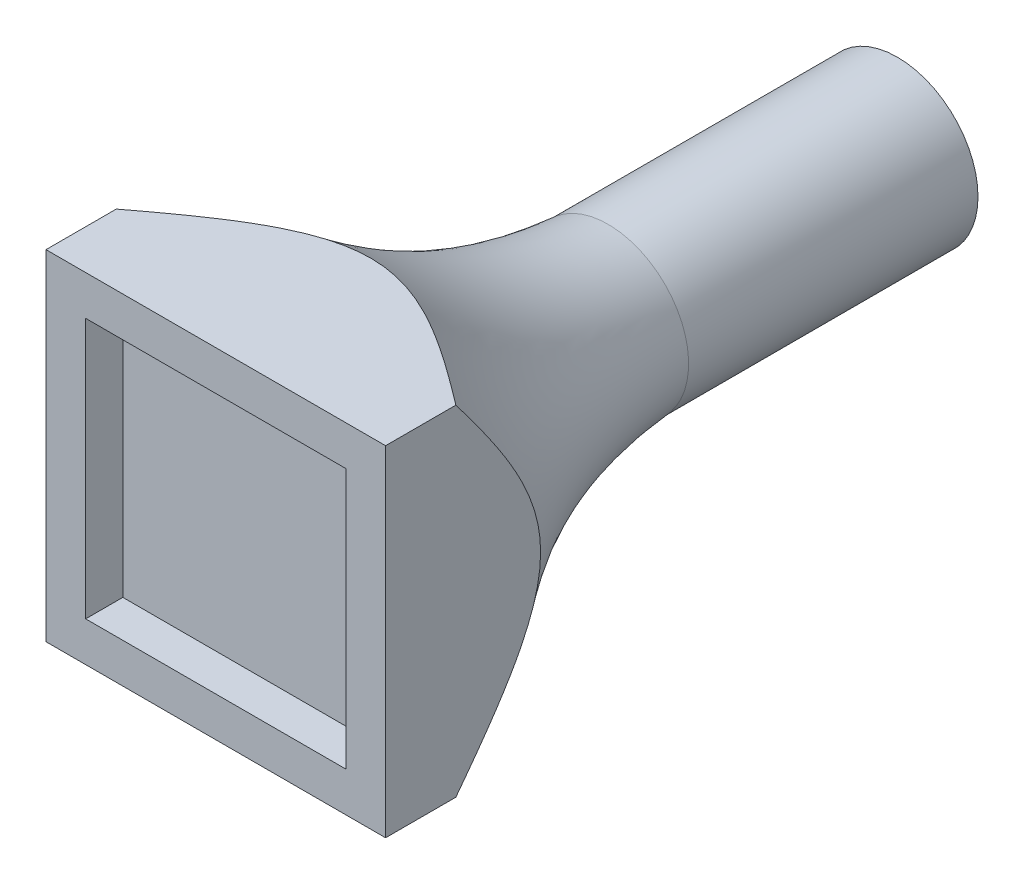
ISO-10303-21;
HEADER;
FILE_DESCRIPTION(('STEP AP214'),'2;1');
FILE_NAME('part.step','',(''),(''),'','','');
FILE_SCHEMA(('AUTOMOTIVE_DESIGN { 1 0 10303 214 1 1 1 1 }'));
ENDSEC;
DATA;
#1=APPLICATION_CONTEXT('core data for automotive mechanical design processes');
#2=APPLICATION_PROTOCOL_DEFINITION('international standard','automotive_design',2000,#1);
#3=PRODUCT_CONTEXT('',#1,'mechanical');
#4=PRODUCT('Part','Part','',(#3));
#5=PRODUCT_RELATED_PRODUCT_CATEGORY('part','',(#4));
#6=PRODUCT_DEFINITION_FORMATION('','',#4);
#7=PRODUCT_DEFINITION_CONTEXT('part definition',#1,'design');
#8=PRODUCT_DEFINITION('design','',#6,#7);
#9=PRODUCT_DEFINITION_SHAPE('','',#8);
#10=(LENGTH_UNIT() NAMED_UNIT(*) SI_UNIT(.MILLI.,.METRE.));
#11=(NAMED_UNIT(*) PLANE_ANGLE_UNIT() SI_UNIT($,.RADIAN.));
#12=(NAMED_UNIT(*) SI_UNIT($,.STERADIAN.) SOLID_ANGLE_UNIT());
#13=UNCERTAINTY_MEASURE_WITH_UNIT(LENGTH_MEASURE(1.E-05),#10,'distance_accuracy_value','');
#14=(GEOMETRIC_REPRESENTATION_CONTEXT(3) GLOBAL_UNCERTAINTY_ASSIGNED_CONTEXT((#13)) GLOBAL_UNIT_ASSIGNED_CONTEXT((#10,
#11,#12)) REPRESENTATION_CONTEXT('',''));
#15=CARTESIAN_POINT('',(0.,0.,0.));
#16=DIRECTION('',(0.,0.,1.));
#17=DIRECTION('',(1.,0.,0.));
#18=AXIS2_PLACEMENT_3D('',#15,#16,#17);
#19=CARTESIAN_POINT('',(13.7,13.7,55.));
#20=DIRECTION('',(-1.,0.,0.));
#21=DIRECTION('',(0.,-1.,0.));
#22=AXIS2_PLACEMENT_3D('',#19,#20,#21);
#23=PLANE('',#22);
#24=DIRECTION('',(0.,0.,-1.));
#25=VECTOR('',#24,1.);
#26=CARTESIAN_POINT('',(13.7,-13.7,55.));
#27=LINE('',#26,#25);
#28=CARTESIAN_POINT('',(13.7,-13.7,55.));
#29=VERTEX_POINT('',#28);
#30=CARTESIAN_POINT('',(13.7,-13.7,49.3319690130509));
#31=VERTEX_POINT('',#30);
#32=EDGE_CURVE('E286',#29,#31,#27,.T.);
#33=ORIENTED_EDGE('',*,*,#32,.T.);
#34=CARTESIAN_POINT('',(13.7,13.7,49.3319690130508));
#35=CARTESIAN_POINT('',(13.7,13.4529593319036,49.1436677663841));
#36=CARTESIAN_POINT('',(13.7,13.2054086943863,48.9560301564443));
#37=CARTESIAN_POINT('',(13.7,12.7082563871221,48.5818774315628));
#38=CARTESIAN_POINT('',(13.7,12.4586507358479,48.3953676097145));
#39=CARTESIAN_POINT('',(13.7,11.9573428621229,48.0240357854787));
#40=CARTESIAN_POINT('',(13.7,11.7056372585732,47.8392183409763));
#41=CARTESIAN_POINT('',(13.7,11.2000154207749,47.4719330033712));
#42=CARTESIAN_POINT('',(13.7,10.9460967400396,47.2894684734799));
#43=CARTESIAN_POINT('',(13.7,10.4358682857531,46.9276401919869));
#44=CARTESIAN_POINT('',(13.7,10.1795573979703,46.7482780090311));
#45=CARTESIAN_POINT('',(13.7,9.6521994413727,46.385202456641));
#46=CARTESIAN_POINT('',(13.7,9.38102289730896,46.2016766765887));
#47=CARTESIAN_POINT('',(13.7,8.8352800973779,45.840090651467));
#48=CARTESIAN_POINT('',(13.7,8.56071602879636,45.662027114441));
#49=CARTESIAN_POINT('',(13.7,8.0076094365377,45.3127245355967));
#50=CARTESIAN_POINT('',(13.7,7.72907070884515,45.1414795061764));
#51=CARTESIAN_POINT('',(13.7,7.1672617743155,44.8074452261275));
#52=CARTESIAN_POINT('',(13.7,6.88399568723085,44.6446490740098));
#53=CARTESIAN_POINT('',(13.7,6.31175806319427,44.3294662735099));
#54=CARTESIAN_POINT('',(13.7,6.02278764850594,44.1770776033687));
#55=CARTESIAN_POINT('',(13.7,5.52137157165149,43.9267521161752));
#56=CARTESIAN_POINT('',(13.7,5.31051006515778,43.8256456939996));
#57=CARTESIAN_POINT('',(13.7,4.88517843415764,43.6312252023687));
#58=CARTESIAN_POINT('',(13.7,4.67070791504506,43.5379119917554));
#59=CARTESIAN_POINT('',(13.7,4.23797729295138,43.3603668333435));
#60=CARTESIAN_POINT('',(13.7,4.01971653208071,43.2761364807657));
#61=CARTESIAN_POINT('',(13.7,3.58147428392627,43.1189520003611));
#62=CARTESIAN_POINT('',(13.7,3.36152851776665,43.0458988855125));
#63=CARTESIAN_POINT('',(13.7,2.91805492833534,42.9116039679602));
#64=CARTESIAN_POINT('',(13.7,2.69452737514733,42.8503612791917));
#65=CARTESIAN_POINT('',(13.7,2.24427357761111,42.7411642421615));
#66=CARTESIAN_POINT('',(13.7,2.01754810491023,42.693206743982));
#67=CARTESIAN_POINT('',(13.7,1.59849076070551,42.618492075058));
#68=CARTESIAN_POINT('',(13.7,1.40654672076051,42.5895576884166));
#69=CARTESIAN_POINT('',(13.7,1.02132304738292,42.5425624408081));
#70=CARTESIAN_POINT('',(13.7,0.828043435110975,42.5245014079627));
#71=CARTESIAN_POINT('',(13.7,0.440783840593894,42.4996770864843));
#72=CARTESIAN_POINT('',(13.7,0.246803963374242,42.4929121688959));
#73=CARTESIAN_POINT('',(13.7,-0.141167604163201,42.4908382942361));
#74=CARTESIAN_POINT('',(13.7,-0.335159278727361,42.49552640315));
#75=CARTESIAN_POINT('',(13.7,-0.722562073735484,42.5162411592981));
#76=CARTESIAN_POINT('',(13.7,-0.915973104567532,42.532269474592));
#77=CARTESIAN_POINT('',(13.7,-1.30156362619016,42.5752867887748));
#78=CARTESIAN_POINT('',(13.7,-1.49374308682004,42.6022760550592));
#79=CARTESIAN_POINT('',(13.7,-1.93414257005715,42.676348103267));
#80=CARTESIAN_POINT('',(13.7,-2.18175925269245,42.727037601292));
#81=CARTESIAN_POINT('',(13.7,-2.67325309259267,42.8443287631922));
#82=CARTESIAN_POINT('',(13.7,-2.91712866902882,42.9109369666808));
#83=CARTESIAN_POINT('',(13.7,-3.40061940580901,43.0581550125064));
#84=CARTESIAN_POINT('',(13.7,-3.64023399190404,43.1387667265509));
#85=CARTESIAN_POINT('',(13.7,-4.11772809613263,43.3130657312705));
#86=CARTESIAN_POINT('',(13.7,-4.35555662218088,43.4068917195769));
#87=CARTESIAN_POINT('',(13.7,-4.82670472716805,43.605043116729));
#88=CARTESIAN_POINT('',(13.7,-5.06002537158895,43.7093660074264));
#89=CARTESIAN_POINT('',(13.7,-5.52244562199262,43.9268856449548));
#90=CARTESIAN_POINT('',(13.7,-5.75154558192341,44.040081643462));
#91=CARTESIAN_POINT('',(13.7,-6.26103148751497,44.3023223562161));
#92=CARTESIAN_POINT('',(13.7,-6.54036861488167,44.4533995591554));
#93=CARTESIAN_POINT('',(13.7,-7.09383057314619,44.7648344315505));
#94=CARTESIAN_POINT('',(13.7,-7.36795477805446,44.9251932063431));
#95=CARTESIAN_POINT('',(13.7,-7.91186617286955,45.2534780872752));
#96=CARTESIAN_POINT('',(13.7,-8.18165035124725,45.4214091644557));
#97=CARTESIAN_POINT('',(13.7,-8.71756365352042,45.7634140608311));
#98=CARTESIAN_POINT('',(13.7,-8.98368993192364,45.9374923235439));
#99=CARTESIAN_POINT('',(13.7,-9.51282307289084,46.2906039608608));
#100=CARTESIAN_POINT('',(13.7,-9.77582826855052,46.4696398268486));
#101=CARTESIAN_POINT('',(13.7,-10.2869012570364,46.8232063140213));
#102=CARTESIAN_POINT('',(13.7,-10.5350935009813,46.9975574564434));
#103=CARTESIAN_POINT('',(13.7,-11.0292915006364,47.3491176776357));
#104=CARTESIAN_POINT('',(13.7,-11.2752980987054,47.5263255740577));
#105=CARTESIAN_POINT('',(13.7,-11.7653016596219,47.882944839558));
#106=CARTESIAN_POINT('',(13.7,-12.0093005009323,48.0623536309329));
#107=CARTESIAN_POINT('',(13.7,-12.4954081319328,48.4227972348016));
#108=CARTESIAN_POINT('',(13.7,-12.737519543178,48.6038285166026));
#109=CARTESIAN_POINT('',(13.7,-13.2199123450693,48.9670233772547));
#110=CARTESIAN_POINT('',(13.7,-13.4601968483078,49.1491828200272));
#111=CARTESIAN_POINT('',(13.7,-13.7,49.3319690130509));
#112=B_SPLINE_CURVE_WITH_KNOTS('',3,(#34,#35,#36,#37,#38,#39,#40,#41,#42,#43,#44,#45,#46,#47,
#48,#49,#50,#51,#52,#53,#54,#55,#56,#57,#58,#59,#60,#61,#62,#63,#64,#65,#66,#67,#68,#69,#70,#71,
#72,#73,#74,#75,#76,#77,#78,#79,#80,#81,#82,#83,#84,#85,#86,#87,#88,#89,#90,#91,#92,#93,#94,#95,
#96,#97,#98,#99,#100,#101,#102,#103,#104,#105,#106,#107,#108,#109,#110,#111),.UNSPECIFIED.,.F.,
.F.,(4,2,2,2,2,2,2,2,2,2,2,2,2,2,2,2,2,2,2,2,2,2,2,2,2,2,2,2,2,2,2,2,2,2,2,2,2,2,4),(0.,
0.931871858543939,1.86663666088971,2.80343628570343,3.74145257585771,4.67993005401387,
5.66220570612649,6.64387724623974,7.62466682329742,8.60464220537222,9.58442667259584,
10.2858406973184,10.9873319188546,11.6889461431913,12.3839338310801,13.0788693579419,
13.7736399743318,14.3556906001464,14.9377320250765,15.5196895095149,16.1014979248103,
16.6833919375669,17.2653001466488,18.0229451598451,18.7809019602197,19.5389601470677,
20.3056677770033,21.0721919146013,21.8386514759033,22.791145937931,23.743754066273,
24.6969969330134,25.6509435577237,26.6053786031,27.5152871761579,28.4248283630725,
29.3333903208054,30.2403078478948,31.1448812566702),.UNSPECIFIED.);
#113=CARTESIAN_POINT('',(13.7,13.7,49.3319690130508));
#114=VERTEX_POINT('',#113);
#115=EDGE_CURVE('E212',#114,#31,#112,.T.);
#116=ORIENTED_EDGE('',*,*,#115,.F.);
#117=DIRECTION('',(0.,0.,-1.));
#118=VECTOR('',#117,1.);
#119=CARTESIAN_POINT('',(13.7,13.7,55.));
#120=LINE('',#119,#118);
#121=CARTESIAN_POINT('',(13.7,13.7,55.));
#122=VERTEX_POINT('',#121);
#123=EDGE_CURVE('E41',#122,#114,#120,.T.);
#124=ORIENTED_EDGE('',*,*,#123,.F.);
#125=DIRECTION('',(0.,1.,0.));
#126=VECTOR('',#125,1.);
#127=CARTESIAN_POINT('',(13.7,13.7,55.));
#128=LINE('',#127,#126);
#129=EDGE_CURVE('E272',#29,#122,#128,.T.);
#130=ORIENTED_EDGE('',*,*,#129,.F.);
#131=EDGE_LOOP('',(#33,#116,#124,#130));
#132=FACE_BOUND('',#131,.T.);
#133=ADVANCED_FACE('F33',(#132),#23,.F.);
#134=CARTESIAN_POINT('',(13.7,13.7,55.));
#135=DIRECTION('',(0.,-1.,0.));
#136=DIRECTION('',(1.,0.,0.));
#137=AXIS2_PLACEMENT_3D('',#134,#135,#136);
#138=PLANE('',#137);
#139=ORIENTED_EDGE('',*,*,#123,.T.);
#140=CARTESIAN_POINT('',(-13.7,13.7,49.3319690130508));
#141=CARTESIAN_POINT('',(-13.4529593319036,13.7,49.1436677663841));
#142=CARTESIAN_POINT('',(-13.2054086943863,13.7,48.9560301564443));
#143=CARTESIAN_POINT('',(-12.7082563871221,13.7,48.5818774315628));
#144=CARTESIAN_POINT('',(-12.4586507358479,13.7,48.3953676097145));
#145=CARTESIAN_POINT('',(-11.9573428621228,13.7,48.0240357854787));
#146=CARTESIAN_POINT('',(-11.7056372585732,13.7,47.8392183409763));
#147=CARTESIAN_POINT('',(-11.2000154207749,13.7,47.4719330033712));
#148=CARTESIAN_POINT('',(-10.9460967400396,13.7,47.2894684734799));
#149=CARTESIAN_POINT('',(-10.4358682857531,13.7,46.9276401919869));
#150=CARTESIAN_POINT('',(-10.1795573979703,13.7,46.7482780090311));
#151=CARTESIAN_POINT('',(-9.65219944137269,13.7,46.385202456641));
#152=CARTESIAN_POINT('',(-9.38102289730896,13.7,46.2016766765887));
#153=CARTESIAN_POINT('',(-8.8352800973779,13.7,45.840090651467));
#154=CARTESIAN_POINT('',(-8.56071602879636,13.7,45.662027114441));
#155=CARTESIAN_POINT('',(-8.00760943653769,13.7,45.3127245355967));
#156=CARTESIAN_POINT('',(-7.72907070884515,13.7,45.1414795061764));
#157=CARTESIAN_POINT('',(-7.16726177431549,13.7,44.8074452261275));
#158=CARTESIAN_POINT('',(-6.88399568723084,13.7,44.6446490740098));
#159=CARTESIAN_POINT('',(-6.31175806319426,13.7,44.3294662735099));
#160=CARTESIAN_POINT('',(-6.02278764850594,13.7,44.1770776033687));
#161=CARTESIAN_POINT('',(-5.52137157165149,13.7,43.9267521161752));
#162=CARTESIAN_POINT('',(-5.31051006515777,13.7,43.8256456939996));
#163=CARTESIAN_POINT('',(-4.88517843415763,13.7,43.6312252023687));
#164=CARTESIAN_POINT('',(-4.67070791504506,13.7,43.5379119917554));
#165=CARTESIAN_POINT('',(-4.23797729295138,13.7,43.3603668333435));
#166=CARTESIAN_POINT('',(-4.01971653208071,13.7,43.2761364807657));
#167=CARTESIAN_POINT('',(-3.58147428392627,13.7,43.1189520003611));
#168=CARTESIAN_POINT('',(-3.36152851776665,13.7,43.0458988855125));
#169=CARTESIAN_POINT('',(-2.91805492833534,13.7,42.9116039679602));
#170=CARTESIAN_POINT('',(-2.69452737514733,13.7,42.8503612791917));
#171=CARTESIAN_POINT('',(-2.2442735776111,13.7,42.7411642421616));
#172=CARTESIAN_POINT('',(-2.01754810491022,13.7,42.693206743982));
#173=CARTESIAN_POINT('',(-1.59849076070551,13.7,42.618492075058));
#174=CARTESIAN_POINT('',(-1.4065467207605,13.7,42.5895576884166));
#175=CARTESIAN_POINT('',(-1.02132304738292,13.7,42.5425624408081));
#176=CARTESIAN_POINT('',(-0.828043435110971,13.7,42.5245014079627));
#177=CARTESIAN_POINT('',(-0.44078384059389,13.7,42.4996770864843));
#178=CARTESIAN_POINT('',(-0.246803963374238,13.7,42.4929121688959));
#179=CARTESIAN_POINT('',(0.141167604163205,13.7,42.4908382942361));
#180=CARTESIAN_POINT('',(0.335159278727364,13.7,42.49552640315));
#181=CARTESIAN_POINT('',(0.722562073735488,13.7,42.5162411592982));
#182=CARTESIAN_POINT('',(0.915973104567536,13.7,42.532269474592));
#183=CARTESIAN_POINT('',(1.30156362619016,13.7,42.5752867887748));
#184=CARTESIAN_POINT('',(1.49374308682005,13.7,42.6022760550592));
#185=CARTESIAN_POINT('',(1.93414257005716,13.7,42.676348103267));
#186=CARTESIAN_POINT('',(2.18175925269245,13.7,42.727037601292));
#187=CARTESIAN_POINT('',(2.67325309259268,13.7,42.8443287631922));
#188=CARTESIAN_POINT('',(2.91712866902883,13.7,42.9109369666808));
#189=CARTESIAN_POINT('',(3.40061940580901,13.7,43.0581550125064));
#190=CARTESIAN_POINT('',(3.64023399190404,13.7,43.1387667265509));
#191=CARTESIAN_POINT('',(4.11772809613263,13.7,43.3130657312705));
#192=CARTESIAN_POINT('',(4.35555662218089,13.7,43.4068917195769));
#193=CARTESIAN_POINT('',(4.82670472716805,13.7,43.605043116729));
#194=CARTESIAN_POINT('',(5.06002537158895,13.7,43.7093660074264));
#195=CARTESIAN_POINT('',(5.52244562199262,13.7,43.9268856449548));
#196=CARTESIAN_POINT('',(5.75154558192341,13.7,44.040081643462));
#197=CARTESIAN_POINT('',(6.26103148751498,13.7,44.3023223562161));
#198=CARTESIAN_POINT('',(6.54036861488167,13.7,44.4533995591554));
#199=CARTESIAN_POINT('',(7.09383057314619,13.7,44.7648344315505));
#200=CARTESIAN_POINT('',(7.36795477805446,13.7,44.9251932063431));
#201=CARTESIAN_POINT('',(7.91186617286955,13.7,45.2534780872752));
#202=CARTESIAN_POINT('',(8.18165035124725,13.7,45.4214091644557));
#203=CARTESIAN_POINT('',(8.71756365352041,13.7,45.7634140608311));
#204=CARTESIAN_POINT('',(8.98368993192363,13.7,45.9374923235439));
#205=CARTESIAN_POINT('',(9.51282307289084,13.7,46.2906039608608));
#206=CARTESIAN_POINT('',(9.77582826855051,13.7,46.4696398268486));
#207=CARTESIAN_POINT('',(10.2869012570364,13.7,46.8232063140213));
#208=CARTESIAN_POINT('',(10.5350935009813,13.7,46.9975574564434));
#209=CARTESIAN_POINT('',(11.0292915006364,13.7,47.3491176776357));
#210=CARTESIAN_POINT('',(11.2752980987053,13.7,47.5263255740577));
#211=CARTESIAN_POINT('',(11.7653016596219,13.7,47.882944839558));
#212=CARTESIAN_POINT('',(12.0093005009323,13.7,48.0623536309329));
#213=CARTESIAN_POINT('',(12.4954081319328,13.7,48.4227972348016));
#214=CARTESIAN_POINT('',(12.737519543178,13.7,48.6038285166026));
#215=CARTESIAN_POINT('',(13.2199123450693,13.7,48.9670233772547));
#216=CARTESIAN_POINT('',(13.4601968483078,13.7,49.1491828200272));
#217=CARTESIAN_POINT('',(13.7,13.7,49.3319690130509));
#218=B_SPLINE_CURVE_WITH_KNOTS('',3,(#140,#141,#142,#143,#144,#145,#146,#147,#148,#149,#150,
#151,#152,#153,#154,#155,#156,#157,#158,#159,#160,#161,#162,#163,#164,#165,#166,#167,#168,#169,
#170,#171,#172,#173,#174,#175,#176,#177,#178,#179,#180,#181,#182,#183,#184,#185,#186,#187,#188,
#189,#190,#191,#192,#193,#194,#195,#196,#197,#198,#199,#200,#201,#202,#203,#204,#205,#206,#207,
#208,#209,#210,#211,#212,#213,#214,#215,#216,#217),.UNSPECIFIED.,.F.,.F.,(4,2,2,2,2,2,2,2,2,2,2,
2,2,2,2,2,2,2,2,2,2,2,2,2,2,2,2,2,2,2,2,2,2,2,2,2,2,2,4),(0.,0.931871858543945,1.86663666088972,
2.80343628570343,3.74145257585771,4.67993005401387,5.66220570612649,6.64387724623974,
7.62466682329742,8.60464220537222,9.58442667259584,10.2858406973184,10.9873319188546,
11.6889461431913,12.3839338310801,13.0788693579419,13.7736399743318,14.3556906001464,
14.9377320250765,15.5196895095149,16.1014979248103,16.6833919375669,17.2653001466488,
18.0229451598451,18.7809019602197,19.5389601470677,20.3056677770033,21.0721919146013,
21.8386514759033,22.791145937931,23.743754066273,24.6969969330134,25.6509435577237,
26.6053786031,27.5152871761579,28.4248283630724,29.3333903208054,30.2403078478948,
31.1448812566701),.UNSPECIFIED.);
#219=CARTESIAN_POINT('',(-13.7,13.7,49.3319690130508));
#220=VERTEX_POINT('',#219);
#221=EDGE_CURVE('E234',#220,#114,#218,.T.);
#222=ORIENTED_EDGE('',*,*,#221,.F.);
#223=DIRECTION('',(0.,0.,-1.));
#224=VECTOR('',#223,1.);
#225=CARTESIAN_POINT('',(-13.7,13.7,55.));
#226=LINE('',#225,#224);
#227=CARTESIAN_POINT('',(-13.7,13.7,55.));
#228=VERTEX_POINT('',#227);
#229=EDGE_CURVE('E289',#228,#220,#226,.T.);
#230=ORIENTED_EDGE('',*,*,#229,.F.);
#231=DIRECTION('',(-1.,0.,0.));
#232=VECTOR('',#231,1.);
#233=CARTESIAN_POINT('',(13.7,13.7,55.));
#234=LINE('',#233,#232);
#235=EDGE_CURVE('E280',#122,#228,#234,.T.);
#236=ORIENTED_EDGE('',*,*,#235,.F.);
#237=EDGE_LOOP('',(#139,#222,#230,#236));
#238=FACE_BOUND('',#237,.T.);
#239=ADVANCED_FACE('F294',(#238),#138,.F.);
#240=CARTESIAN_POINT('',(-13.7,13.7,55.));
#241=DIRECTION('',(1.,0.,0.));
#242=DIRECTION('',(0.,1.,0.));
#243=AXIS2_PLACEMENT_3D('',#240,#241,#242);
#244=PLANE('',#243);
#245=ORIENTED_EDGE('',*,*,#229,.T.);
#246=CARTESIAN_POINT('',(-13.7,-13.7,49.3319690130509));
#247=CARTESIAN_POINT('',(-13.7,-13.4529593319036,49.1436677663841));
#248=CARTESIAN_POINT('',(-13.7,-13.2054086943863,48.9560301564443));
#249=CARTESIAN_POINT('',(-13.7,-12.7082563871221,48.5818774315628));
#250=CARTESIAN_POINT('',(-13.7,-12.4586507358479,48.3953676097145));
#251=CARTESIAN_POINT('',(-13.7,-11.9573428621228,48.0240357854787));
#252=CARTESIAN_POINT('',(-13.7,-11.7056372585732,47.8392183409763));
#253=CARTESIAN_POINT('',(-13.7,-11.2000154207749,47.4719330033712));
#254=CARTESIAN_POINT('',(-13.7,-10.9460967400396,47.2894684734799));
#255=CARTESIAN_POINT('',(-13.7,-10.4358682857531,46.9276401919869));
#256=CARTESIAN_POINT('',(-13.7,-10.1795573979703,46.7482780090311));
#257=CARTESIAN_POINT('',(-13.7,-9.65219944137268,46.385202456641));
#258=CARTESIAN_POINT('',(-13.7,-9.38102289730895,46.2016766765887));
#259=CARTESIAN_POINT('',(-13.7,-8.83528009737788,45.840090651467));
#260=CARTESIAN_POINT('',(-13.7,-8.56071602879634,45.662027114441));
#261=CARTESIAN_POINT('',(-13.7,-8.00760943653767,45.3127245355967));
#262=CARTESIAN_POINT('',(-13.7,-7.72907070884512,45.1414795061764));
#263=CARTESIAN_POINT('',(-13.7,-7.16726177431546,44.8074452261275));
#264=CARTESIAN_POINT('',(-13.7,-6.88399568723081,44.6446490740098));
#265=CARTESIAN_POINT('',(-13.7,-6.31175806319423,44.3294662735099));
#266=CARTESIAN_POINT('',(-13.7,-6.02278764850591,44.1770776033687));
#267=CARTESIAN_POINT('',(-13.7,-5.52137157165145,43.9267521161752));
#268=CARTESIAN_POINT('',(-13.7,-5.31051006515773,43.8256456939996));
#269=CARTESIAN_POINT('',(-13.7,-4.88517843415759,43.6312252023687));
#270=CARTESIAN_POINT('',(-13.7,-4.67070791504502,43.5379119917554));
#271=CARTESIAN_POINT('',(-13.7,-4.23797729295133,43.3603668333435));
#272=CARTESIAN_POINT('',(-13.7,-4.01971653208067,43.2761364807657));
#273=CARTESIAN_POINT('',(-13.7,-3.58147428392622,43.1189520003611));
#274=CARTESIAN_POINT('',(-13.7,-3.3615285177666,43.0458988855125));
#275=CARTESIAN_POINT('',(-13.7,-2.91805492833529,42.9116039679602));
#276=CARTESIAN_POINT('',(-13.7,-2.69452737514728,42.8503612791917));
#277=CARTESIAN_POINT('',(-13.7,-2.24427357761105,42.7411642421615));
#278=CARTESIAN_POINT('',(-13.7,-2.01754810491017,42.693206743982));
#279=CARTESIAN_POINT('',(-13.7,-1.59849076070546,42.6184920750579));
#280=CARTESIAN_POINT('',(-13.7,-1.40654672076045,42.5895576884166));
#281=CARTESIAN_POINT('',(-13.7,-1.02132304738287,42.5425624408081));
#282=CARTESIAN_POINT('',(-13.7,-0.828043435110919,42.5245014079627));
#283=CARTESIAN_POINT('',(-13.7,-0.440783840593837,42.4996770864843));
#284=CARTESIAN_POINT('',(-13.7,-0.246803963374184,42.4929121688959));
#285=CARTESIAN_POINT('',(-13.7,0.141167604163261,42.4908382942361));
#286=CARTESIAN_POINT('',(-13.7,0.335159278727421,42.49552640315));
#287=CARTESIAN_POINT('',(-13.7,0.722562073735545,42.5162411592981));
#288=CARTESIAN_POINT('',(-13.7,0.915973104567593,42.532269474592));
#289=CARTESIAN_POINT('',(-13.7,1.30156362619022,42.5752867887748));
#290=CARTESIAN_POINT('',(-13.7,1.4937430868201,42.6022760550592));
#291=CARTESIAN_POINT('',(-13.7,1.93414257005722,42.676348103267));
#292=CARTESIAN_POINT('',(-13.7,2.18175925269252,42.727037601292));
#293=CARTESIAN_POINT('',(-13.7,2.67325309259275,42.8443287631922));
#294=CARTESIAN_POINT('',(-13.7,2.9171286690289,42.9109369666808));
#295=CARTESIAN_POINT('',(-13.7,3.40061940580909,43.0581550125064));
#296=CARTESIAN_POINT('',(-13.7,3.64023399190412,43.1387667265509));
#297=CARTESIAN_POINT('',(-13.7,4.11772809613272,43.3130657312706));
#298=CARTESIAN_POINT('',(-13.7,4.35555662218098,43.406891719577));
#299=CARTESIAN_POINT('',(-13.7,4.82670472716815,43.605043116729));
#300=CARTESIAN_POINT('',(-13.7,5.06002537158905,43.7093660074264));
#301=CARTESIAN_POINT('',(-13.7,5.52244562199272,43.9268856449548));
#302=CARTESIAN_POINT('',(-13.7,5.75154558192351,44.040081643462));
#303=CARTESIAN_POINT('',(-13.7,6.26103148751507,44.3023223562161));
#304=CARTESIAN_POINT('',(-13.7,6.54036861488177,44.4533995591554));
#305=CARTESIAN_POINT('',(-13.7,7.09383057314627,44.7648344315506));
#306=CARTESIAN_POINT('',(-13.7,7.36795477805454,44.9251932063432));
#307=CARTESIAN_POINT('',(-13.7,7.91186617286962,45.2534780872752));
#308=CARTESIAN_POINT('',(-13.7,8.18165035124732,45.4214091644558));
#309=CARTESIAN_POINT('',(-13.7,8.71756365352047,45.7634140608311));
#310=CARTESIAN_POINT('',(-13.7,8.9836899319237,45.9374923235439));
#311=CARTESIAN_POINT('',(-13.7,9.51282307289089,46.2906039608608));
#312=CARTESIAN_POINT('',(-13.7,9.77582826855056,46.4696398268486));
#313=CARTESIAN_POINT('',(-13.7,10.2869012570364,46.8232063140214));
#314=CARTESIAN_POINT('',(-13.7,10.5350935009813,46.9975574564434));
#315=CARTESIAN_POINT('',(-13.7,11.0292915006364,47.3491176776357));
#316=CARTESIAN_POINT('',(-13.7,11.2752980987054,47.5263255740577));
#317=CARTESIAN_POINT('',(-13.7,11.7653016596219,47.882944839558));
#318=CARTESIAN_POINT('',(-13.7,12.0093005009323,48.0623536309329));
#319=CARTESIAN_POINT('',(-13.7,12.4954081319328,48.4227972348016));
#320=CARTESIAN_POINT('',(-13.7,12.737519543178,48.6038285166026));
#321=CARTESIAN_POINT('',(-13.7,13.2199123450693,48.9670233772547));
#322=CARTESIAN_POINT('',(-13.7,13.4601968483078,49.1491828200272));
#323=CARTESIAN_POINT('',(-13.7,13.7,49.3319690130509));
#324=B_SPLINE_CURVE_WITH_KNOTS('',3,(#246,#247,#248,#249,#250,#251,#252,#253,#254,#255,#256,
#257,#258,#259,#260,#261,#262,#263,#264,#265,#266,#267,#268,#269,#270,#271,#272,#273,#274,#275,
#276,#277,#278,#279,#280,#281,#282,#283,#284,#285,#286,#287,#288,#289,#290,#291,#292,#293,#294,
#295,#296,#297,#298,#299,#300,#301,#302,#303,#304,#305,#306,#307,#308,#309,#310,#311,#312,#313,
#314,#315,#316,#317,#318,#319,#320,#321,#322,#323),.UNSPECIFIED.,.F.,.F.,(4,2,2,2,2,2,2,2,2,2,2,
2,2,2,2,2,2,2,2,2,2,2,2,2,2,2,2,2,2,2,2,2,2,2,2,2,2,2,4),(0.,0.931871858543944,1.86663666088973,
2.80343628570345,3.74145257585774,4.6799300540139,5.66220570612652,6.64387724623978,
7.62466682329747,8.60464220537228,9.5844266725959,10.2858406973185,10.9873319188546,
11.6889461431914,12.3839338310802,13.078869357942,13.7736399743319,14.3556906001465,
14.9377320250766,15.519689509515,16.1014979248103,16.6833919375669,17.2653001466489,
18.0229451598452,18.7809019602198,19.5389601470678,20.3056677770034,21.0721919146014,
21.8386514759035,22.7911459379312,23.7437540662731,24.6969969330135,25.6509435577238,
26.6053786031001,27.515287176158,28.4248283630725,29.3333903208055,30.2403078478948,
31.1448812566702),.UNSPECIFIED.);
#325=CARTESIAN_POINT('',(-13.7,-13.7,49.3319690130509));
#326=VERTEX_POINT('',#325);
#327=EDGE_CURVE('E228',#326,#220,#324,.T.);
#328=ORIENTED_EDGE('',*,*,#327,.F.);
#329=DIRECTION('',(0.,0.,-1.));
#330=VECTOR('',#329,1.);
#331=CARTESIAN_POINT('',(-13.7,-13.7,55.));
#332=LINE('',#331,#330);
#333=CARTESIAN_POINT('',(-13.7,-13.7,55.));
#334=VERTEX_POINT('',#333);
#335=EDGE_CURVE('E48',#334,#326,#332,.T.);
#336=ORIENTED_EDGE('',*,*,#335,.F.);
#337=DIRECTION('',(0.,-1.,0.));
#338=VECTOR('',#337,1.);
#339=CARTESIAN_POINT('',(-13.7,13.7,55.));
#340=LINE('',#339,#338);
#341=EDGE_CURVE('E282',#228,#334,#340,.T.);
#342=ORIENTED_EDGE('',*,*,#341,.F.);
#343=EDGE_LOOP('',(#245,#328,#336,#342));
#344=FACE_BOUND('',#343,.T.);
#345=ADVANCED_FACE('F303',(#344),#244,.F.);
#346=CARTESIAN_POINT('',(13.7,-13.7,55.));
#347=DIRECTION('',(0.,1.,0.));
#348=DIRECTION('',(-1.,0.,0.));
#349=AXIS2_PLACEMENT_3D('',#346,#347,#348);
#350=PLANE('',#349);
#351=ORIENTED_EDGE('',*,*,#335,.T.);
#352=CARTESIAN_POINT('',(13.7,-13.7,49.3319690130509));
#353=CARTESIAN_POINT('',(13.4529593319037,-13.7,49.1436677663841));
#354=CARTESIAN_POINT('',(13.2054086943863,-13.7,48.9560301564443));
#355=CARTESIAN_POINT('',(12.7082563871221,-13.7,48.5818774315628));
#356=CARTESIAN_POINT('',(12.4586507358479,-13.7,48.3953676097145));
#357=CARTESIAN_POINT('',(11.9573428621229,-13.7,48.0240357854787));
#358=CARTESIAN_POINT('',(11.7056372585733,-13.7,47.8392183409763));
#359=CARTESIAN_POINT('',(11.2000154207749,-13.7,47.4719330033712));
#360=CARTESIAN_POINT('',(10.9460967400396,-13.7,47.2894684734799));
#361=CARTESIAN_POINT('',(10.4358682857531,-13.7,46.9276401919869));
#362=CARTESIAN_POINT('',(10.1795573979703,-13.7,46.7482780090311));
#363=CARTESIAN_POINT('',(9.6521994413727,-13.7,46.385202456641));
#364=CARTESIAN_POINT('',(9.38102289730896,-13.7,46.2016766765887));
#365=CARTESIAN_POINT('',(8.8352800973779,-13.7,45.840090651467));
#366=CARTESIAN_POINT('',(8.56071602879636,-13.7,45.662027114441));
#367=CARTESIAN_POINT('',(8.00760943653768,-13.7,45.3127245355967));
#368=CARTESIAN_POINT('',(7.72907070884513,-13.7,45.1414795061764));
#369=CARTESIAN_POINT('',(7.16726177431547,-13.7,44.8074452261275));
#370=CARTESIAN_POINT('',(6.88399568723083,-13.7,44.6446490740098));
#371=CARTESIAN_POINT('',(6.31175806319424,-13.7,44.3294662735099));
#372=CARTESIAN_POINT('',(6.02278764850591,-13.7,44.1770776033687));
#373=CARTESIAN_POINT('',(5.52137157165146,-13.7,43.9267521161752));
#374=CARTESIAN_POINT('',(5.31051006515774,-13.7,43.8256456939996));
#375=CARTESIAN_POINT('',(4.88517843415761,-13.7,43.6312252023687));
#376=CARTESIAN_POINT('',(4.67070791504503,-13.7,43.5379119917554));
#377=CARTESIAN_POINT('',(4.23797729295134,-13.7,43.3603668333435));
#378=CARTESIAN_POINT('',(4.01971653208068,-13.7,43.2761364807657));
#379=CARTESIAN_POINT('',(3.58147428392623,-13.7,43.1189520003611));
#380=CARTESIAN_POINT('',(3.36152851776661,-13.7,43.0458988855125));
#381=CARTESIAN_POINT('',(2.9180549283353,-13.7,42.9116039679602));
#382=CARTESIAN_POINT('',(2.69452737514729,-13.7,42.8503612791917));
#383=CARTESIAN_POINT('',(2.24427357761106,-13.7,42.7411642421615));
#384=CARTESIAN_POINT('',(2.01754810491018,-13.7,42.693206743982));
#385=CARTESIAN_POINT('',(1.59849076070547,-13.7,42.6184920750579));
#386=CARTESIAN_POINT('',(1.40654672076046,-13.7,42.5895576884166));
#387=CARTESIAN_POINT('',(1.02132304738288,-13.7,42.5425624408081));
#388=CARTESIAN_POINT('',(0.828043435110932,-13.7,42.5245014079627));
#389=CARTESIAN_POINT('',(0.44078384059385,-13.7,42.4996770864843));
#390=CARTESIAN_POINT('',(0.246803963374198,-13.7,42.4929121688959));
#391=CARTESIAN_POINT('',(-0.141167604163246,-13.7,42.4908382942361));
#392=CARTESIAN_POINT('',(-0.335159278727406,-13.7,42.49552640315));
#393=CARTESIAN_POINT('',(-0.72256207373553,-13.7,42.5162411592981));
#394=CARTESIAN_POINT('',(-0.915973104567578,-13.7,42.532269474592));
#395=CARTESIAN_POINT('',(-1.30156362619021,-13.7,42.5752867887748));
#396=CARTESIAN_POINT('',(-1.49374308682009,-13.7,42.6022760550592));
#397=CARTESIAN_POINT('',(-1.9341425700572,-13.7,42.676348103267));
#398=CARTESIAN_POINT('',(-2.1817592526925,-13.7,42.727037601292));
#399=CARTESIAN_POINT('',(-2.67325309259273,-13.7,42.8443287631922));
#400=CARTESIAN_POINT('',(-2.91712866902888,-13.7,42.9109369666808));
#401=CARTESIAN_POINT('',(-3.40061940580906,-13.7,43.0581550125064));
#402=CARTESIAN_POINT('',(-3.6402339919041,-13.7,43.1387667265509));
#403=CARTESIAN_POINT('',(-4.11772809613269,-13.7,43.3130657312706));
#404=CARTESIAN_POINT('',(-4.35555662218095,-13.7,43.406891719577));
#405=CARTESIAN_POINT('',(-4.82670472716812,-13.7,43.605043116729));
#406=CARTESIAN_POINT('',(-5.06002537158902,-13.7,43.7093660074264));
#407=CARTESIAN_POINT('',(-5.52244562199269,-13.7,43.9268856449548));
#408=CARTESIAN_POINT('',(-5.75154558192348,-13.7,44.040081643462));
#409=CARTESIAN_POINT('',(-6.26103148751504,-13.7,44.3023223562161));
#410=CARTESIAN_POINT('',(-6.54036861488174,-13.7,44.4533995591554));
#411=CARTESIAN_POINT('',(-7.09383057314624,-13.7,44.7648344315505));
#412=CARTESIAN_POINT('',(-7.36795477805451,-13.7,44.9251932063432));
#413=CARTESIAN_POINT('',(-7.91186617286959,-13.7,45.2534780872752));
#414=CARTESIAN_POINT('',(-8.18165035124729,-13.7,45.4214091644558));
#415=CARTESIAN_POINT('',(-8.71756365352045,-13.7,45.7634140608311));
#416=CARTESIAN_POINT('',(-8.98368993192367,-13.7,45.9374923235439));
#417=CARTESIAN_POINT('',(-9.51282307289086,-13.7,46.2906039608608));
#418=CARTESIAN_POINT('',(-9.77582826855054,-13.7,46.4696398268486));
#419=CARTESIAN_POINT('',(-10.2869012570364,-13.7,46.8232063140213));
#420=CARTESIAN_POINT('',(-10.5350935009813,-13.7,46.9975574564434));
#421=CARTESIAN_POINT('',(-11.0292915006364,-13.7,47.3491176776357));
#422=CARTESIAN_POINT('',(-11.2752980987054,-13.7,47.5263255740577));
#423=CARTESIAN_POINT('',(-11.7653016596219,-13.7,47.882944839558));
#424=CARTESIAN_POINT('',(-12.0093005009323,-13.7,48.0623536309329));
#425=CARTESIAN_POINT('',(-12.4954081319328,-13.7,48.4227972348016));
#426=CARTESIAN_POINT('',(-12.737519543178,-13.7,48.6038285166026));
#427=CARTESIAN_POINT('',(-13.2199123450693,-13.7,48.9670233772547));
#428=CARTESIAN_POINT('',(-13.4601968483078,-13.7,49.1491828200272));
#429=CARTESIAN_POINT('',(-13.7,-13.7,49.3319690130509));
#430=B_SPLINE_CURVE_WITH_KNOTS('',3,(#352,#353,#354,#355,#356,#357,#358,#359,#360,#361,#362,
#363,#364,#365,#366,#367,#368,#369,#370,#371,#372,#373,#374,#375,#376,#377,#378,#379,#380,#381,
#382,#383,#384,#385,#386,#387,#388,#389,#390,#391,#392,#393,#394,#395,#396,#397,#398,#399,#400,
#401,#402,#403,#404,#405,#406,#407,#408,#409,#410,#411,#412,#413,#414,#415,#416,#417,#418,#419,
#420,#421,#422,#423,#424,#425,#426,#427,#428,#429),.UNSPECIFIED.,.F.,.F.,(4,2,2,2,2,2,2,2,2,2,2,
2,2,2,2,2,2,2,2,2,2,2,2,2,2,2,2,2,2,2,2,2,2,2,2,2,2,2,4),(0.,0.931871858543943,1.86663666088973,
2.80343628570345,3.74145257585773,4.67993005401389,5.66220570612652,6.64387724623978,
7.62466682329747,8.60464220537227,9.5844266725959,10.2858406973185,10.9873319188546,
11.6889461431914,12.3839338310802,13.078869357942,13.7736399743319,14.3556906001465,
14.9377320250766,15.519689509515,16.1014979248103,16.6833919375669,17.2653001466489,
18.0229451598451,18.7809019602198,19.5389601470678,20.3056677770034,21.0721919146014,
21.8386514759034,22.7911459379311,23.7437540662731,24.6969969330135,25.6509435577238,
26.6053786031001,27.5152871761579,28.4248283630725,29.3333903208055,30.2403078478948,
31.1448812566702),.UNSPECIFIED.);
#431=EDGE_CURVE('E204',#31,#326,#430,.T.);
#432=ORIENTED_EDGE('',*,*,#431,.F.);
#433=ORIENTED_EDGE('',*,*,#32,.F.);
#434=DIRECTION('',(1.,0.,0.));
#435=VECTOR('',#434,1.);
#436=CARTESIAN_POINT('',(13.7,-13.7,55.));
#437=LINE('',#436,#435);
#438=EDGE_CURVE('E284',#334,#29,#437,.T.);
#439=ORIENTED_EDGE('',*,*,#438,.F.);
#440=EDGE_LOOP('',(#351,#432,#433,#439));
#441=FACE_BOUND('',#440,.T.);
#442=ADVANCED_FACE('F307',(#441),#350,.F.);
#443=CARTESIAN_POINT('',(0.,0.,55.));
#444=DIRECTION('',(0.,0.,-1.));
#445=DIRECTION('',(-1.,0.,0.));
#446=AXIS2_PLACEMENT_3D('',#443,#444,#445);
#447=PLANE('',#446);
#448=DIRECTION('',(1.,0.,0.));
#449=VECTOR('',#448,1.);
#450=CARTESIAN_POINT('',(10.5,-10.5,55.));
#451=LINE('',#450,#449);
#452=CARTESIAN_POINT('',(-10.5,-10.5,55.));
#453=VERTEX_POINT('',#452);
#454=CARTESIAN_POINT('',(10.5,-10.5,55.));
#455=VERTEX_POINT('',#454);
#456=EDGE_CURVE('E262',#453,#455,#451,.T.);
#457=ORIENTED_EDGE('',*,*,#456,.F.);
#458=DIRECTION('',(0.,-1.,0.));
#459=VECTOR('',#458,1.);
#460=CARTESIAN_POINT('',(-10.5,10.5,55.));
#461=LINE('',#460,#459);
#462=CARTESIAN_POINT('',(-10.5,10.5,55.));
#463=VERTEX_POINT('',#462);
#464=EDGE_CURVE('E56',#463,#453,#461,.T.);
#465=ORIENTED_EDGE('',*,*,#464,.F.);
#466=DIRECTION('',(-1.,0.,0.));
#467=VECTOR('',#466,1.);
#468=CARTESIAN_POINT('',(10.5,10.5,55.));
#469=LINE('',#468,#467);
#470=CARTESIAN_POINT('',(10.5,10.5,55.));
#471=VERTEX_POINT('',#470);
#472=EDGE_CURVE('E251',#471,#463,#469,.T.);
#473=ORIENTED_EDGE('',*,*,#472,.F.);
#474=DIRECTION('',(0.,1.,0.));
#475=VECTOR('',#474,1.);
#476=CARTESIAN_POINT('',(10.5,10.5,55.));
#477=LINE('',#476,#475);
#478=EDGE_CURVE('E265',#455,#471,#477,.T.);
#479=ORIENTED_EDGE('',*,*,#478,.F.);
#480=EDGE_LOOP('',(#457,#465,#473,#479));
#481=FACE_BOUND('',#480,.T.);
#482=ORIENTED_EDGE('',*,*,#129,.T.);
#483=ORIENTED_EDGE('',*,*,#235,.T.);
#484=ORIENTED_EDGE('',*,*,#341,.T.);
#485=ORIENTED_EDGE('',*,*,#438,.T.);
#486=EDGE_LOOP('',(#482,#483,#484,#485));
#487=FACE_BOUND('',#486,.T.);
#488=ADVANCED_FACE('F306',(#481,#487),#447,.F.);
#489=CARTESIAN_POINT('',(-10.5,10.5,52.));
#490=DIRECTION('',(-1.,0.,0.));
#491=DIRECTION('',(0.,-1.,0.));
#492=AXIS2_PLACEMENT_3D('',#489,#490,#491);
#493=PLANE('',#492);
#494=ORIENTED_EDGE('',*,*,#464,.T.);
#495=DIRECTION('',(0.,0.,1.));
#496=VECTOR('',#495,1.);
#497=CARTESIAN_POINT('',(-10.5,-10.5,52.));
#498=LINE('',#497,#496);
#499=CARTESIAN_POINT('',(-10.5,-10.5,52.));
#500=VERTEX_POINT('',#499);
#501=EDGE_CURVE('E260',#500,#453,#498,.T.);
#502=ORIENTED_EDGE('',*,*,#501,.F.);
#503=DIRECTION('',(0.,-1.,0.));
#504=VECTOR('',#503,1.);
#505=CARTESIAN_POINT('',(-10.5,10.5,52.));
#506=LINE('',#505,#504);
#507=CARTESIAN_POINT('',(-10.5,10.5,52.));
#508=VERTEX_POINT('',#507);
#509=EDGE_CURVE('E247',#508,#500,#506,.T.);
#510=ORIENTED_EDGE('',*,*,#509,.F.);
#511=DIRECTION('',(0.,0.,1.));
#512=VECTOR('',#511,1.);
#513=CARTESIAN_POINT('',(-10.5,10.5,52.));
#514=LINE('',#513,#512);
#515=EDGE_CURVE('E270',#508,#463,#514,.T.);
#516=ORIENTED_EDGE('',*,*,#515,.T.);
#517=EDGE_LOOP('',(#494,#502,#510,#516));
#518=FACE_BOUND('',#517,.T.);
#519=ADVANCED_FACE('F314',(#518),#493,.F.);
#520=CARTESIAN_POINT('',(10.5,10.5,52.));
#521=DIRECTION('',(0.,1.,0.));
#522=DIRECTION('',(-1.,0.,0.));
#523=AXIS2_PLACEMENT_3D('',#520,#521,#522);
#524=PLANE('',#523);
#525=ORIENTED_EDGE('',*,*,#472,.T.);
#526=ORIENTED_EDGE('',*,*,#515,.F.);
#527=DIRECTION('',(-1.,0.,0.));
#528=VECTOR('',#527,1.);
#529=CARTESIAN_POINT('',(10.5,10.5,52.));
#530=LINE('',#529,#528);
#531=CARTESIAN_POINT('',(10.5,10.5,52.));
#532=VERTEX_POINT('',#531);
#533=EDGE_CURVE('E257',#532,#508,#530,.T.);
#534=ORIENTED_EDGE('',*,*,#533,.F.);
#535=DIRECTION('',(0.,0.,1.));
#536=VECTOR('',#535,1.);
#537=CARTESIAN_POINT('',(10.5,10.5,52.));
#538=LINE('',#537,#536);
#539=EDGE_CURVE('E273',#532,#471,#538,.T.);
#540=ORIENTED_EDGE('',*,*,#539,.T.);
#541=EDGE_LOOP('',(#525,#526,#534,#540));
#542=FACE_BOUND('',#541,.T.);
#543=ADVANCED_FACE('F497',(#542),#524,.F.);
#544=CARTESIAN_POINT('',(10.5,10.5,52.));
#545=DIRECTION('',(1.,0.,0.));
#546=DIRECTION('',(0.,0.,-1.));
#547=AXIS2_PLACEMENT_3D('',#544,#545,#546);
#548=PLANE('',#547);
#549=ORIENTED_EDGE('',*,*,#478,.T.);
#550=ORIENTED_EDGE('',*,*,#539,.F.);
#551=DIRECTION('',(0.,1.,0.));
#552=VECTOR('',#551,1.);
#553=CARTESIAN_POINT('',(10.5,10.5,52.));
#554=LINE('',#553,#552);
#555=CARTESIAN_POINT('',(10.5,-10.5,52.));
#556=VERTEX_POINT('',#555);
#557=EDGE_CURVE('E254',#556,#532,#554,.T.);
#558=ORIENTED_EDGE('',*,*,#557,.F.);
#559=DIRECTION('',(0.,0.,1.));
#560=VECTOR('',#559,1.);
#561=CARTESIAN_POINT('',(10.5,-10.5,52.));
#562=LINE('',#561,#560);
#563=EDGE_CURVE('E275',#556,#455,#562,.T.);
#564=ORIENTED_EDGE('',*,*,#563,.T.);
#565=EDGE_LOOP('',(#549,#550,#558,#564));
#566=FACE_BOUND('',#565,.T.);
#567=ADVANCED_FACE('F487',(#566),#548,.F.);
#568=CARTESIAN_POINT('',(10.5,-10.5,52.));
#569=DIRECTION('',(0.,-1.,0.));
#570=DIRECTION('',(1.,0.,0.));
#571=AXIS2_PLACEMENT_3D('',#568,#569,#570);
#572=PLANE('',#571);
#573=ORIENTED_EDGE('',*,*,#456,.T.);
#574=ORIENTED_EDGE('',*,*,#563,.F.);
#575=DIRECTION('',(1.,0.,0.));
#576=VECTOR('',#575,1.);
#577=CARTESIAN_POINT('',(10.5,-10.5,52.));
#578=LINE('',#577,#576);
#579=EDGE_CURVE('E250',#500,#556,#578,.T.);
#580=ORIENTED_EDGE('',*,*,#579,.F.);
#581=ORIENTED_EDGE('',*,*,#501,.T.);
#582=EDGE_LOOP('',(#573,#574,#580,#581));
#583=FACE_BOUND('',#582,.T.);
#584=ADVANCED_FACE('F333',(#583),#572,.F.);
#585=CARTESIAN_POINT('',(0.,0.,52.));
#586=DIRECTION('',(0.,0.,-1.));
#587=DIRECTION('',(-1.,0.,0.));
#588=AXIS2_PLACEMENT_3D('',#585,#586,#587);
#589=PLANE('',#588);
#590=ORIENTED_EDGE('',*,*,#509,.T.);
#591=ORIENTED_EDGE('',*,*,#579,.T.);
#592=ORIENTED_EDGE('',*,*,#557,.T.);
#593=ORIENTED_EDGE('',*,*,#533,.T.);
#594=EDGE_LOOP('',(#590,#591,#592,#593));
#595=FACE_BOUND('',#594,.T.);
#596=ADVANCED_FACE('F326',(#595),#589,.F.);
#597=CARTESIAN_POINT('',(0.,0.,0.));
#598=DIRECTION('',(0.,0.,1.));
#599=DIRECTION('',(1.,0.,0.));
#600=AXIS2_PLACEMENT_3D('',#597,#598,#599);
#601=PLANE('',#600);
#602=CARTESIAN_POINT('',(0.,0.,0.));
#603=DIRECTION('',(0.,0.,-1.));
#604=DIRECTION('',(-1.,0.,0.));
#605=AXIS2_PLACEMENT_3D('',#602,#603,#604);
#606=CIRCLE('',#605,2.15);
#607=CARTESIAN_POINT('',(-2.15,0.,0.));
#608=VERTEX_POINT('',#607);
#609=EDGE_CURVE('E201',#608,#608,#606,.T.);
#610=ORIENTED_EDGE('',*,*,#609,.F.);
#611=EDGE_LOOP('',(#610));
#612=FACE_BOUND('',#611,.T.);
#613=CARTESIAN_POINT('',(0.,0.,0.));
#614=DIRECTION('',(0.,0.,1.));
#615=DIRECTION('',(1.,0.,0.));
#616=AXIS2_PLACEMENT_3D('',#613,#614,#615);
#617=CIRCLE('',#616,6.5);
#618=CARTESIAN_POINT('',(6.5,0.,0.));
#619=VERTEX_POINT('',#618);
#620=EDGE_CURVE('E11',#619,#619,#617,.T.);
#621=ORIENTED_EDGE('',*,*,#620,.F.);
#622=EDGE_LOOP('',(#621));
#623=FACE_BOUND('',#622,.T.);
#624=ADVANCED_FACE('F324',(#612,#623),#601,.F.);
#625=CARTESIAN_POINT('',(0.,0.,50.));
#626=DIRECTION('',(0.,0.,-1.));
#627=DIRECTION('',(-1.,0.,0.));
#628=AXIS2_PLACEMENT_3D('',#625,#626,#627);
#629=CYLINDRICAL_SURFACE('',#628,6.5);
#630=CARTESIAN_POINT('',(0.,0.,23.3491605918884));
#631=DIRECTION('',(0.,0.,-1.));
#632=DIRECTION('',(-1.,0.,0.));
#633=AXIS2_PLACEMENT_3D('',#630,#631,#632);
#634=CIRCLE('',#633,6.5);
#635=CARTESIAN_POINT('',(-6.5,0.,23.3491605918884));
#636=VERTEX_POINT('',#635);
#637=EDGE_CURVE('E233',#636,#636,#634,.T.);
#638=ORIENTED_EDGE('',*,*,#637,.T.);
#639=EDGE_LOOP('',(#638));
#640=FACE_BOUND('',#639,.T.);
#641=ORIENTED_EDGE('',*,*,#620,.T.);
#642=EDGE_LOOP('',(#641));
#643=FACE_BOUND('',#642,.T.);
#644=ADVANCED_FACE('F35',(#640,#643),#629,.T.);
#645=CARTESIAN_POINT('',(0.,6.5,0.));
#646=CARTESIAN_POINT('',(0.,6.5,23.5344902795212));
#647=CARTESIAN_POINT('',(0.,3.31447132982782,32.3301393432568));
#648=CARTESIAN_POINT('',(0.,20.,50.));
#649=B_SPLINE_CURVE_WITH_KNOTS('',3,(#645,#646,#647,#648),.UNSPECIFIED.,.F.,.F.,(4,4),(0.,1.),.UNSPECIFIED.);
#650=CARTESIAN_POINT('',(0.,0.,63.5411709805056));
#651=DIRECTION('',(0.,0.,-1.));
#652=AXIS1_PLACEMENT('',#650,#651);
#653=SURFACE_OF_REVOLUTION('',#649,#652);
#654=ORIENTED_EDGE('',*,*,#637,.F.);
#655=EDGE_LOOP('',(#654));
#656=FACE_BOUND('',#655,.T.);
#657=ORIENTED_EDGE('',*,*,#431,.T.);
#658=ORIENTED_EDGE('',*,*,#327,.T.);
#659=ORIENTED_EDGE('',*,*,#221,.T.);
#660=ORIENTED_EDGE('',*,*,#115,.T.);
#661=EDGE_LOOP('',(#657,#658,#659,#660));
#662=FACE_BOUND('',#661,.T.);
#663=ADVANCED_FACE('F218',(#656,#662),#653,.F.);
#664=CARTESIAN_POINT('',(0.,0.,25.));
#665=DIRECTION('',(0.,0.,-1.));
#666=DIRECTION('',(-1.,0.,0.));
#667=AXIS2_PLACEMENT_3D('',#664,#665,#666);
#668=CYLINDRICAL_SURFACE('',#667,2.15);
#669=CARTESIAN_POINT('',(0.,0.,25.));
#670=DIRECTION('',(0.,0.,-1.));
#671=DIRECTION('',(-1.,0.,0.));
#672=AXIS2_PLACEMENT_3D('',#669,#670,#671);
#673=CIRCLE('',#672,2.15);
#674=CARTESIAN_POINT('',(-2.15,0.,25.));
#675=VERTEX_POINT('',#674);
#676=EDGE_CURVE('E191',#675,#675,#673,.T.);
#677=ORIENTED_EDGE('',*,*,#676,.F.);
#678=EDGE_LOOP('',(#677));
#679=FACE_BOUND('',#678,.T.);
#680=ORIENTED_EDGE('',*,*,#609,.T.);
#681=EDGE_LOOP('',(#680));
#682=FACE_BOUND('',#681,.T.);
#683=ADVANCED_FACE('F340',(#679,#682),#668,.F.);
#684=CARTESIAN_POINT('',(-2.07846096908265,-3.6,28.5));
#685=DIRECTION('',(-0.866025403784439,-0.5,0.));
#686=DIRECTION('',(0.5,-0.866025403784439,0.));
#687=AXIS2_PLACEMENT_3D('',#684,#685,#686);
#688=PLANE('',#687);
#689=DIRECTION('',(-0.5,0.866025403784439,0.));
#690=VECTOR('',#689,1.);
#691=CARTESIAN_POINT('',(-2.07846096908265,-3.6,25.));
#692=LINE('',#691,#690);
#693=CARTESIAN_POINT('',(-2.07846096908265,-3.6,25.));
#694=VERTEX_POINT('',#693);
#695=CARTESIAN_POINT('',(-4.15692193816531,0.,25.));
#696=VERTEX_POINT('',#695);
#697=EDGE_CURVE('E143',#694,#696,#692,.T.);
#698=ORIENTED_EDGE('',*,*,#697,.T.);
#699=DIRECTION('',(0.,0.,-1.));
#700=VECTOR('',#699,1.);
#701=CARTESIAN_POINT('',(-4.15692193816531,0.,28.5));
#702=LINE('',#701,#700);
#703=CARTESIAN_POINT('',(-4.15692193816531,0.,28.5));
#704=VERTEX_POINT('',#703);
#705=EDGE_CURVE('E136',#704,#696,#702,.T.);
#706=ORIENTED_EDGE('',*,*,#705,.F.);
#707=DIRECTION('',(-0.5,0.866025403784439,0.));
#708=VECTOR('',#707,1.);
#709=CARTESIAN_POINT('',(-2.07846096908265,-3.6,28.5));
#710=LINE('',#709,#708);
#711=CARTESIAN_POINT('',(-2.07846096908265,-3.6,28.5));
#712=VERTEX_POINT('',#711);
#713=EDGE_CURVE('E140',#712,#704,#710,.T.);
#714=ORIENTED_EDGE('',*,*,#713,.F.);
#715=DIRECTION('',(0.,0.,-1.));
#716=VECTOR('',#715,1.);
#717=CARTESIAN_POINT('',(-2.07846096908265,-3.6,28.5));
#718=LINE('',#717,#716);
#719=EDGE_CURVE('E189',#712,#694,#718,.T.);
#720=ORIENTED_EDGE('',*,*,#719,.T.);
#721=EDGE_LOOP('',(#698,#706,#714,#720));
#722=FACE_BOUND('',#721,.T.);
#723=ADVANCED_FACE('F138',(#722),#688,.F.);
#724=CARTESIAN_POINT('',(2.07846096908265,-3.6,28.5));
#725=DIRECTION('',(0.,-1.,0.));
#726=DIRECTION('',(1.,0.,0.));
#727=AXIS2_PLACEMENT_3D('',#724,#725,#726);
#728=PLANE('',#727);
#729=DIRECTION('',(-1.,0.,0.));
#730=VECTOR('',#729,1.);
#731=CARTESIAN_POINT('',(2.07846096908265,-3.6,25.));
#732=LINE('',#731,#730);
#733=CARTESIAN_POINT('',(2.07846096908265,-3.6,25.));
#734=VERTEX_POINT('',#733);
#735=EDGE_CURVE('E161',#734,#694,#732,.T.);
#736=ORIENTED_EDGE('',*,*,#735,.T.);
#737=ORIENTED_EDGE('',*,*,#719,.F.);
#738=DIRECTION('',(-1.,0.,0.));
#739=VECTOR('',#738,1.);
#740=CARTESIAN_POINT('',(2.07846096908265,-3.6,28.5));
#741=LINE('',#740,#739);
#742=CARTESIAN_POINT('',(2.07846096908265,-3.6,28.5));
#743=VERTEX_POINT('',#742);
#744=EDGE_CURVE('E148',#743,#712,#741,.T.);
#745=ORIENTED_EDGE('',*,*,#744,.F.);
#746=DIRECTION('',(0.,0.,-1.));
#747=VECTOR('',#746,1.);
#748=CARTESIAN_POINT('',(2.07846096908265,-3.6,28.5));
#749=LINE('',#748,#747);
#750=EDGE_CURVE('E192',#743,#734,#749,.T.);
#751=ORIENTED_EDGE('',*,*,#750,.T.);
#752=EDGE_LOOP('',(#736,#737,#745,#751));
#753=FACE_BOUND('',#752,.T.);
#754=ADVANCED_FACE('F348',(#753),#728,.F.);
#755=CARTESIAN_POINT('',(4.15692193816531,0.,28.5));
#756=DIRECTION('',(0.866025403784439,-0.5,0.));
#757=DIRECTION('',(0.5,0.866025403784439,0.));
#758=AXIS2_PLACEMENT_3D('',#755,#756,#757);
#759=PLANE('',#758);
#760=DIRECTION('',(-0.5,-0.866025403784439,0.));
#761=VECTOR('',#760,1.);
#762=CARTESIAN_POINT('',(4.15692193816531,0.,25.));
#763=LINE('',#762,#761);
#764=CARTESIAN_POINT('',(4.15692193816531,0.,25.));
#765=VERTEX_POINT('',#764);
#766=EDGE_CURVE('E164',#765,#734,#763,.T.);
#767=ORIENTED_EDGE('',*,*,#766,.T.);
#768=ORIENTED_EDGE('',*,*,#750,.F.);
#769=DIRECTION('',(-0.5,-0.866025403784439,0.));
#770=VECTOR('',#769,1.);
#771=CARTESIAN_POINT('',(4.15692193816531,0.,28.5));
#772=LINE('',#771,#770);
#773=CARTESIAN_POINT('',(4.15692193816531,0.,28.5));
#774=VERTEX_POINT('',#773);
#775=EDGE_CURVE('E174',#774,#743,#772,.T.);
#776=ORIENTED_EDGE('',*,*,#775,.F.);
#777=DIRECTION('',(0.,0.,-1.));
#778=VECTOR('',#777,1.);
#779=CARTESIAN_POINT('',(4.15692193816531,0.,28.5));
#780=LINE('',#779,#778);
#781=EDGE_CURVE('E194',#774,#765,#780,.T.);
#782=ORIENTED_EDGE('',*,*,#781,.T.);
#783=EDGE_LOOP('',(#767,#768,#776,#782));
#784=FACE_BOUND('',#783,.T.);
#785=ADVANCED_FACE('F363',(#784),#759,.F.);
#786=CARTESIAN_POINT('',(2.07846096908265,3.6,28.5));
#787=DIRECTION('',(0.866025403784439,0.5,0.));
#788=DIRECTION('',(-0.5,0.866025403784439,0.));
#789=AXIS2_PLACEMENT_3D('',#786,#787,#788);
#790=PLANE('',#789);
#791=DIRECTION('',(0.5,-0.866025403784439,0.));
#792=VECTOR('',#791,1.);
#793=CARTESIAN_POINT('',(2.07846096908265,3.6,25.));
#794=LINE('',#793,#792);
#795=CARTESIAN_POINT('',(2.07846096908265,3.6,25.));
#796=VERTEX_POINT('',#795);
#797=EDGE_CURVE('E184',#796,#765,#794,.T.);
#798=ORIENTED_EDGE('',*,*,#797,.T.);
#799=ORIENTED_EDGE('',*,*,#781,.F.);
#800=DIRECTION('',(0.5,-0.866025403784439,0.));
#801=VECTOR('',#800,1.);
#802=CARTESIAN_POINT('',(2.07846096908265,3.6,28.5));
#803=LINE('',#802,#801);
#804=CARTESIAN_POINT('',(2.07846096908265,3.6,28.5));
#805=VERTEX_POINT('',#804);
#806=EDGE_CURVE('E171',#805,#774,#803,.T.);
#807=ORIENTED_EDGE('',*,*,#806,.F.);
#808=DIRECTION('',(0.,0.,-1.));
#809=VECTOR('',#808,1.);
#810=CARTESIAN_POINT('',(2.07846096908265,3.6,28.5));
#811=LINE('',#810,#809);
#812=EDGE_CURVE('E196',#805,#796,#811,.T.);
#813=ORIENTED_EDGE('',*,*,#812,.T.);
#814=EDGE_LOOP('',(#798,#799,#807,#813));
#815=FACE_BOUND('',#814,.T.);
#816=ADVANCED_FACE('F359',(#815),#790,.F.);
#817=CARTESIAN_POINT('',(-2.07846096908265,3.6,28.5));
#818=DIRECTION('',(0.,1.,0.));
#819=DIRECTION('',(0.,0.,1.));
#820=AXIS2_PLACEMENT_3D('',#817,#818,#819);
#821=PLANE('',#820);
#822=DIRECTION('',(1.,0.,0.));
#823=VECTOR('',#822,1.);
#824=CARTESIAN_POINT('',(-2.07846096908265,3.6,25.));
#825=LINE('',#824,#823);
#826=CARTESIAN_POINT('',(-2.07846096908265,3.6,25.));
#827=VERTEX_POINT('',#826);
#828=EDGE_CURVE('E181',#827,#796,#825,.T.);
#829=ORIENTED_EDGE('',*,*,#828,.T.);
#830=ORIENTED_EDGE('',*,*,#812,.F.);
#831=DIRECTION('',(1.,0.,0.));
#832=VECTOR('',#831,1.);
#833=CARTESIAN_POINT('',(-2.07846096908265,3.6,28.5));
#834=LINE('',#833,#832);
#835=CARTESIAN_POINT('',(-2.07846096908265,3.6,28.5));
#836=VERTEX_POINT('',#835);
#837=EDGE_CURVE('E156',#836,#805,#834,.T.);
#838=ORIENTED_EDGE('',*,*,#837,.F.);
#839=DIRECTION('',(0.,0.,-1.));
#840=VECTOR('',#839,1.);
#841=CARTESIAN_POINT('',(-2.07846096908265,3.6,28.5));
#842=LINE('',#841,#840);
#843=EDGE_CURVE('E147',#836,#827,#842,.T.);
#844=ORIENTED_EDGE('',*,*,#843,.T.);
#845=EDGE_LOOP('',(#829,#830,#838,#844));
#846=FACE_BOUND('',#845,.T.);
#847=ADVANCED_FACE('F356',(#846),#821,.F.);
#848=CARTESIAN_POINT('',(-4.15692193816531,0.,28.5));
#849=DIRECTION('',(-0.866025403784438,0.5,0.));
#850=DIRECTION('',(-0.5,-0.866025403784439,0.));
#851=AXIS2_PLACEMENT_3D('',#848,#849,#850);
#852=PLANE('',#851);
#853=DIRECTION('',(0.5,0.866025403784438,0.));
#854=VECTOR('',#853,1.);
#855=CARTESIAN_POINT('',(-4.15692193816531,0.,25.));
#856=LINE('',#855,#854);
#857=EDGE_CURVE('E178',#696,#827,#856,.T.);
#858=ORIENTED_EDGE('',*,*,#857,.T.);
#859=ORIENTED_EDGE('',*,*,#843,.F.);
#860=DIRECTION('',(0.5,0.866025403784438,0.));
#861=VECTOR('',#860,1.);
#862=CARTESIAN_POINT('',(-4.15692193816531,0.,28.5));
#863=LINE('',#862,#861);
#864=EDGE_CURVE('E151',#704,#836,#863,.T.);
#865=ORIENTED_EDGE('',*,*,#864,.F.);
#866=ORIENTED_EDGE('',*,*,#705,.T.);
#867=EDGE_LOOP('',(#858,#859,#865,#866));
#868=FACE_BOUND('',#867,.T.);
#869=ADVANCED_FACE('F152',(#868),#852,.F.);
#870=CARTESIAN_POINT('',(0.,0.,28.5));
#871=DIRECTION('',(0.,0.,-1.));
#872=DIRECTION('',(-1.,0.,0.));
#873=AXIS2_PLACEMENT_3D('',#870,#871,#872);
#874=PLANE('',#873);
#875=CARTESIAN_POINT('',(0.,0.,28.5));
#876=DIRECTION('',(0.,0.,-1.));
#877=DIRECTION('',(-1.,0.,0.));
#878=AXIS2_PLACEMENT_3D('',#875,#876,#877);
#879=CIRCLE('',#878,2.15);
#880=CARTESIAN_POINT('',(-2.15,0.,28.5));
#881=VERTEX_POINT('',#880);
#882=EDGE_CURVE('E167',#881,#881,#879,.T.);
#883=ORIENTED_EDGE('',*,*,#882,.F.);
#884=EDGE_LOOP('',(#883));
#885=FACE_BOUND('',#884,.T.);
#886=ORIENTED_EDGE('',*,*,#713,.T.);
#887=ORIENTED_EDGE('',*,*,#864,.T.);
#888=ORIENTED_EDGE('',*,*,#837,.T.);
#889=ORIENTED_EDGE('',*,*,#806,.T.);
#890=ORIENTED_EDGE('',*,*,#775,.T.);
#891=ORIENTED_EDGE('',*,*,#744,.T.);
#892=EDGE_LOOP('',(#886,#887,#888,#889,#890,#891));
#893=FACE_BOUND('',#892,.T.);
#894=ADVANCED_FACE('F158',(#885,#893),#874,.T.);
#895=CARTESIAN_POINT('',(0.,0.,25.));
#896=DIRECTION('',(0.,0.,-1.));
#897=DIRECTION('',(-1.,0.,0.));
#898=AXIS2_PLACEMENT_3D('',#895,#896,#897);
#899=PLANE('',#898);
#900=ORIENTED_EDGE('',*,*,#676,.T.);
#901=EDGE_LOOP('',(#900));
#902=FACE_BOUND('',#901,.T.);
#903=ORIENTED_EDGE('',*,*,#697,.F.);
#904=ORIENTED_EDGE('',*,*,#735,.F.);
#905=ORIENTED_EDGE('',*,*,#766,.F.);
#906=ORIENTED_EDGE('',*,*,#797,.F.);
#907=ORIENTED_EDGE('',*,*,#828,.F.);
#908=ORIENTED_EDGE('',*,*,#857,.F.);
#909=EDGE_LOOP('',(#903,#904,#905,#906,#907,#908));
#910=FACE_BOUND('',#909,.T.);
#911=ADVANCED_FACE('F371',(#902,#910),#899,.F.);
#912=CARTESIAN_POINT('',(0.,0.,43.5));
#913=DIRECTION('',(0.,0.,-1.));
#914=DIRECTION('',(-1.,0.,0.));
#915=AXIS2_PLACEMENT_3D('',#912,#913,#914);
#916=CYLINDRICAL_SURFACE('',#915,2.15);
#917=CARTESIAN_POINT('',(0.,0.,43.5));
#918=DIRECTION('',(0.,0.,-1.));
#919=DIRECTION('',(-1.,0.,0.));
#920=AXIS2_PLACEMENT_3D('',#917,#918,#919);
#921=CIRCLE('',#920,2.15);
#922=CARTESIAN_POINT('',(-2.15,0.,43.5));
#923=VERTEX_POINT('',#922);
#924=EDGE_CURVE('E179',#923,#923,#921,.T.);
#925=ORIENTED_EDGE('',*,*,#924,.F.);
#926=EDGE_LOOP('',(#925));
#927=FACE_BOUND('',#926,.T.);
#928=ORIENTED_EDGE('',*,*,#882,.T.);
#929=EDGE_LOOP('',(#928));
#930=FACE_BOUND('',#929,.T.);
#931=ADVANCED_FACE('F374',(#927,#930),#916,.F.);
#932=CARTESIAN_POINT('',(0.,0.,43.5));
#933=DIRECTION('',(0.,0.,-1.));
#934=DIRECTION('',(-1.,0.,0.));
#935=AXIS2_PLACEMENT_3D('',#932,#933,#934);
#936=PLANE('',#935);
#937=ORIENTED_EDGE('',*,*,#924,.T.);
#938=EDGE_LOOP('',(#937));
#939=FACE_BOUND('',#938,.T.);
#940=ADVANCED_FACE('F381',(#939),#936,.T.);
#941=CLOSED_SHELL('',(#133,#239,#345,#442,#488,#519,#543,#567,#584,#596,#624,#644,#663,#683,
#723,#754,#785,#816,#847,#869,#894,#911,#931,#940));
#942=MANIFOLD_SOLID_BREP('B2',#941);
#943=ADVANCED_BREP_SHAPE_REPRESENTATION('',(#18,#942),#14);
#944=SHAPE_DEFINITION_REPRESENTATION(#9,#943);
ENDSEC;
END-ISO-10303-21;
